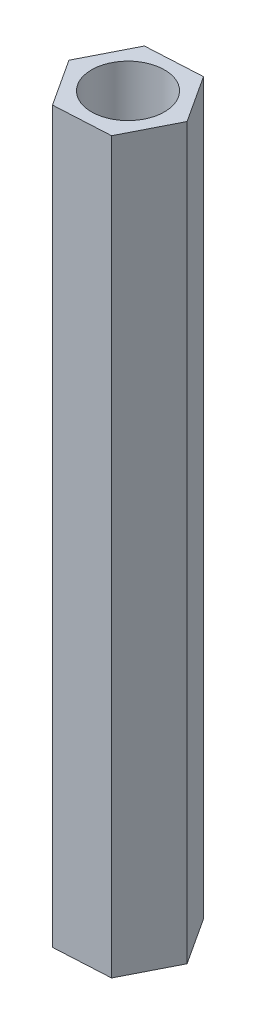
ISO-10303-21;
HEADER;
FILE_DESCRIPTION(('STEP AP214'),'2;1');
FILE_NAME('part.step','',(''),(''),'','','');
FILE_SCHEMA(('AUTOMOTIVE_DESIGN { 1 0 10303 214 1 1 1 1 }'));
ENDSEC;
DATA;
#1=APPLICATION_CONTEXT('core data for automotive mechanical design processes');
#2=APPLICATION_PROTOCOL_DEFINITION('international standard','automotive_design',2000,#1);
#3=PRODUCT_CONTEXT('',#1,'mechanical');
#4=PRODUCT('Part','Part','',(#3));
#5=PRODUCT_RELATED_PRODUCT_CATEGORY('part','',(#4));
#6=PRODUCT_DEFINITION_FORMATION('','',#4);
#7=PRODUCT_DEFINITION_CONTEXT('part definition',#1,'design');
#8=PRODUCT_DEFINITION('design','',#6,#7);
#9=PRODUCT_DEFINITION_SHAPE('','',#8);
#10=(LENGTH_UNIT() NAMED_UNIT(*) SI_UNIT(.MILLI.,.METRE.));
#11=(NAMED_UNIT(*) PLANE_ANGLE_UNIT() SI_UNIT($,.RADIAN.));
#12=(NAMED_UNIT(*) SI_UNIT($,.STERADIAN.) SOLID_ANGLE_UNIT());
#13=UNCERTAINTY_MEASURE_WITH_UNIT(LENGTH_MEASURE(1.E-05),#10,'distance_accuracy_value','');
#14=(GEOMETRIC_REPRESENTATION_CONTEXT(3) GLOBAL_UNCERTAINTY_ASSIGNED_CONTEXT((#13)) GLOBAL_UNIT_ASSIGNED_CONTEXT((#10,
#11,#12)) REPRESENTATION_CONTEXT('',''));
#15=CARTESIAN_POINT('',(0.,0.,0.));
#16=DIRECTION('',(0.,0.,1.));
#17=DIRECTION('',(1.,0.,0.));
#18=AXIS2_PLACEMENT_3D('',#15,#16,#17);
#19=CARTESIAN_POINT('',(0.,30.,0.));
#20=DIRECTION('',(0.,1.,0.));
#21=DIRECTION('',(0.,0.,1.));
#22=AXIS2_PLACEMENT_3D('',#19,#20,#21);
#23=PLANE('',#22);
#24=DIRECTION('',(-0.998564215398102,0.,0.0535677862747038));
#25=VECTOR('',#24,1.);
#26=CARTESIAN_POINT('',(1.04590706457704,30.,-2.05898318244739));
#27=LINE('',#26,#25);
#28=CARTESIAN_POINT('',(1.04590706457704,30.,-2.05898318244739));
#29=VERTEX_POINT('',#28);
#30=CARTESIAN_POINT('',(-1.26017820967585,30.,-1.93527367914502));
#31=VERTEX_POINT('',#30);
#32=EDGE_CURVE('E150',#29,#31,#27,.T.);
#33=ORIENTED_EDGE('',*,*,#32,.T.);
#34=DIRECTION('',(-0.452891043960662,0.,0.891565870982185));
#35=VECTOR('',#34,1.);
#36=CARTESIAN_POINT('',(-1.26017820967585,30.,-1.93527367914502));
#37=LINE('',#36,#35);
#38=CARTESIAN_POINT('',(-2.30608527425289,30.,0.123709503302371));
#39=VERTEX_POINT('',#38);
#40=EDGE_CURVE('E98',#31,#39,#37,.T.);
#41=ORIENTED_EDGE('',*,*,#40,.T.);
#42=DIRECTION('',(0.54567317143744,0.,0.83799808470748));
#43=VECTOR('',#42,1.);
#44=CARTESIAN_POINT('',(-2.30608527425289,30.,0.123709503302371));
#45=LINE('',#44,#43);
#46=CARTESIAN_POINT('',(-1.04590706457703,30.,2.05898318244739));
#47=VERTEX_POINT('',#46);
#48=EDGE_CURVE('E111',#39,#47,#45,.T.);
#49=ORIENTED_EDGE('',*,*,#48,.T.);
#50=DIRECTION('',(0.998564215398102,0.,-0.0535677862747038));
#51=VECTOR('',#50,1.);
#52=CARTESIAN_POINT('',(-1.04590706457703,30.,2.05898318244739));
#53=LINE('',#52,#51);
#54=CARTESIAN_POINT('',(1.26017820967585,30.,1.93527367914502));
#55=VERTEX_POINT('',#54);
#56=EDGE_CURVE('E105',#47,#55,#53,.T.);
#57=ORIENTED_EDGE('',*,*,#56,.T.);
#58=DIRECTION('',(0.452891043960662,0.,-0.891565870982185));
#59=VECTOR('',#58,1.);
#60=CARTESIAN_POINT('',(1.26017820967585,30.,1.93527367914502));
#61=LINE('',#60,#59);
#62=CARTESIAN_POINT('',(2.30608527425289,30.,-0.123709503302371));
#63=VERTEX_POINT('',#62);
#64=EDGE_CURVE('E109',#55,#63,#61,.T.);
#65=ORIENTED_EDGE('',*,*,#64,.T.);
#66=DIRECTION('',(-0.54567317143744,0.,-0.837998084707481));
#67=VECTOR('',#66,1.);
#68=CARTESIAN_POINT('',(2.30608527425289,30.,-0.123709503302371));
#69=LINE('',#68,#67);
#70=EDGE_CURVE('E61',#63,#29,#69,.T.);
#71=ORIENTED_EDGE('',*,*,#70,.T.);
#72=EDGE_LOOP('',(#33,#41,#49,#57,#65,#71));
#73=FACE_BOUND('',#72,.T.);
#74=CARTESIAN_POINT('',(0.,30.,0.));
#75=DIRECTION('',(0.,1.,0.));
#76=DIRECTION('',(0.,0.,1.));
#77=AXIS2_PLACEMENT_3D('',#74,#75,#76);
#78=CIRCLE('',#77,1.5);
#79=CARTESIAN_POINT('',(0.,30.,1.5));
#80=VERTEX_POINT('',#79);
#81=EDGE_CURVE('E138',#80,#80,#78,.T.);
#82=ORIENTED_EDGE('',*,*,#81,.F.);
#83=EDGE_LOOP('',(#82));
#84=FACE_BOUND('',#83,.T.);
#85=ADVANCED_FACE('F43',(#73,#84),#23,.T.);
#86=CARTESIAN_POINT('',(0.,0.,0.));
#87=DIRECTION('',(0.,1.,0.));
#88=DIRECTION('',(0.,0.,1.));
#89=AXIS2_PLACEMENT_3D('',#86,#87,#88);
#90=PLANE('',#89);
#91=DIRECTION('',(-0.998564215398102,0.,0.0535677862747038));
#92=VECTOR('',#91,1.);
#93=CARTESIAN_POINT('',(1.04590706457704,0.,-2.05898318244739));
#94=LINE('',#93,#92);
#95=CARTESIAN_POINT('',(1.04590706457704,0.,-2.05898318244739));
#96=VERTEX_POINT('',#95);
#97=CARTESIAN_POINT('',(-1.26017820967585,0.,-1.93527367914502));
#98=VERTEX_POINT('',#97);
#99=EDGE_CURVE('E133',#96,#98,#94,.T.);
#100=ORIENTED_EDGE('',*,*,#99,.F.);
#101=DIRECTION('',(-0.54567317143744,0.,-0.837998084707481));
#102=VECTOR('',#101,1.);
#103=CARTESIAN_POINT('',(2.30608527425289,0.,-0.123709503302371));
#104=LINE('',#103,#102);
#105=CARTESIAN_POINT('',(2.30608527425289,0.,-0.123709503302371));
#106=VERTEX_POINT('',#105);
#107=EDGE_CURVE('E90',#106,#96,#104,.T.);
#108=ORIENTED_EDGE('',*,*,#107,.F.);
#109=DIRECTION('',(0.452891043960662,0.,-0.891565870982185));
#110=VECTOR('',#109,1.);
#111=CARTESIAN_POINT('',(1.26017820967585,0.,1.93527367914502));
#112=LINE('',#111,#110);
#113=CARTESIAN_POINT('',(1.26017820967585,0.,1.93527367914502));
#114=VERTEX_POINT('',#113);
#115=EDGE_CURVE('E84',#114,#106,#112,.T.);
#116=ORIENTED_EDGE('',*,*,#115,.F.);
#117=DIRECTION('',(0.998564215398102,0.,-0.0535677862747038));
#118=VECTOR('',#117,1.);
#119=CARTESIAN_POINT('',(-1.04590706457703,0.,2.05898318244739));
#120=LINE('',#119,#118);
#121=CARTESIAN_POINT('',(-1.04590706457703,0.,2.05898318244739));
#122=VERTEX_POINT('',#121);
#123=EDGE_CURVE('E120',#122,#114,#120,.T.);
#124=ORIENTED_EDGE('',*,*,#123,.F.);
#125=DIRECTION('',(0.54567317143744,0.,0.83799808470748));
#126=VECTOR('',#125,1.);
#127=CARTESIAN_POINT('',(-2.30608527425289,0.,0.123709503302371));
#128=LINE('',#127,#126);
#129=CARTESIAN_POINT('',(-2.30608527425289,0.,0.123709503302371));
#130=VERTEX_POINT('',#129);
#131=EDGE_CURVE('E141',#130,#122,#128,.T.);
#132=ORIENTED_EDGE('',*,*,#131,.F.);
#133=DIRECTION('',(-0.452891043960662,0.,0.891565870982185));
#134=VECTOR('',#133,1.);
#135=CARTESIAN_POINT('',(-1.26017820967585,0.,-1.93527367914502));
#136=LINE('',#135,#134);
#137=EDGE_CURVE('E137',#98,#130,#136,.T.);
#138=ORIENTED_EDGE('',*,*,#137,.F.);
#139=EDGE_LOOP('',(#100,#108,#116,#124,#132,#138));
#140=FACE_BOUND('',#139,.T.);
#141=CARTESIAN_POINT('',(0.,0.,0.));
#142=DIRECTION('',(0.,1.,0.));
#143=DIRECTION('',(0.,0.,1.));
#144=AXIS2_PLACEMENT_3D('',#141,#142,#143);
#145=CIRCLE('',#144,1.5);
#146=CARTESIAN_POINT('',(0.,0.,1.5));
#147=VERTEX_POINT('',#146);
#148=EDGE_CURVE('E265',#147,#147,#145,.T.);
#149=ORIENTED_EDGE('',*,*,#148,.T.);
#150=EDGE_LOOP('',(#149));
#151=FACE_BOUND('',#150,.T.);
#152=ADVANCED_FACE('F163',(#140,#151),#90,.F.);
#153=CARTESIAN_POINT('',(1.04590706457704,30.,-2.05898318244739));
#154=DIRECTION('',(0.0535677862747038,0.,0.998564215398102));
#155=DIRECTION('',(0.998564215398102,0.,-0.0535677862747038));
#156=AXIS2_PLACEMENT_3D('',#153,#154,#155);
#157=PLANE('',#156);
#158=ORIENTED_EDGE('',*,*,#99,.T.);
#159=DIRECTION('',(0.,-1.,0.));
#160=VECTOR('',#159,1.);
#161=CARTESIAN_POINT('',(-1.26017820967585,30.,-1.93527367914502));
#162=LINE('',#161,#160);
#163=EDGE_CURVE('E11',#31,#98,#162,.T.);
#164=ORIENTED_EDGE('',*,*,#163,.F.);
#165=ORIENTED_EDGE('',*,*,#32,.F.);
#166=DIRECTION('',(0.,-1.,0.));
#167=VECTOR('',#166,1.);
#168=CARTESIAN_POINT('',(1.04590706457704,30.,-2.05898318244739));
#169=LINE('',#168,#167);
#170=EDGE_CURVE('E129',#29,#96,#169,.T.);
#171=ORIENTED_EDGE('',*,*,#170,.T.);
#172=EDGE_LOOP('',(#158,#164,#165,#171));
#173=FACE_BOUND('',#172,.T.);
#174=ADVANCED_FACE('F45',(#173),#157,.F.);
#175=CARTESIAN_POINT('',(-1.26017820967585,30.,-1.93527367914502));
#176=DIRECTION('',(0.891565870982185,0.,0.452891043960662));
#177=DIRECTION('',(0.452891043960662,0.,-0.891565870982185));
#178=AXIS2_PLACEMENT_3D('',#175,#176,#177);
#179=PLANE('',#178);
#180=ORIENTED_EDGE('',*,*,#137,.T.);
#181=DIRECTION('',(0.,-1.,0.));
#182=VECTOR('',#181,1.);
#183=CARTESIAN_POINT('',(-2.30608527425289,30.,0.123709503302371));
#184=LINE('',#183,#182);
#185=EDGE_CURVE('E53',#39,#130,#184,.T.);
#186=ORIENTED_EDGE('',*,*,#185,.F.);
#187=ORIENTED_EDGE('',*,*,#40,.F.);
#188=ORIENTED_EDGE('',*,*,#163,.T.);
#189=EDGE_LOOP('',(#180,#186,#187,#188));
#190=FACE_BOUND('',#189,.T.);
#191=ADVANCED_FACE('F188',(#190),#179,.F.);
#192=CARTESIAN_POINT('',(-2.30608527425289,30.,0.123709503302371));
#193=DIRECTION('',(0.83799808470748,0.,-0.54567317143744));
#194=DIRECTION('',(-0.54567317143744,0.,-0.83799808470748));
#195=AXIS2_PLACEMENT_3D('',#192,#193,#194);
#196=PLANE('',#195);
#197=ORIENTED_EDGE('',*,*,#131,.T.);
#198=DIRECTION('',(0.,-1.,0.));
#199=VECTOR('',#198,1.);
#200=CARTESIAN_POINT('',(-1.04590706457703,30.,2.05898318244739));
#201=LINE('',#200,#199);
#202=EDGE_CURVE('E122',#47,#122,#201,.T.);
#203=ORIENTED_EDGE('',*,*,#202,.F.);
#204=ORIENTED_EDGE('',*,*,#48,.F.);
#205=ORIENTED_EDGE('',*,*,#185,.T.);
#206=EDGE_LOOP('',(#197,#203,#204,#205));
#207=FACE_BOUND('',#206,.T.);
#208=ADVANCED_FACE('F160',(#207),#196,.F.);
#209=CARTESIAN_POINT('',(-1.04590706457703,30.,2.05898318244739));
#210=DIRECTION('',(-0.0535677862747038,0.,-0.998564215398102));
#211=DIRECTION('',(-0.998564215398102,0.,0.0535677862747038));
#212=AXIS2_PLACEMENT_3D('',#209,#210,#211);
#213=PLANE('',#212);
#214=ORIENTED_EDGE('',*,*,#123,.T.);
#215=DIRECTION('',(0.,-1.,0.));
#216=VECTOR('',#215,1.);
#217=CARTESIAN_POINT('',(1.26017820967585,30.,1.93527367914502));
#218=LINE('',#217,#216);
#219=EDGE_CURVE('E117',#55,#114,#218,.T.);
#220=ORIENTED_EDGE('',*,*,#219,.F.);
#221=ORIENTED_EDGE('',*,*,#56,.F.);
#222=ORIENTED_EDGE('',*,*,#202,.T.);
#223=EDGE_LOOP('',(#214,#220,#221,#222));
#224=FACE_BOUND('',#223,.T.);
#225=ADVANCED_FACE('F118',(#224),#213,.F.);
#226=CARTESIAN_POINT('',(1.26017820967585,30.,1.93527367914502));
#227=DIRECTION('',(-0.891565870982185,0.,-0.452891043960662));
#228=DIRECTION('',(-0.452891043960662,0.,0.891565870982185));
#229=AXIS2_PLACEMENT_3D('',#226,#227,#228);
#230=PLANE('',#229);
#231=ORIENTED_EDGE('',*,*,#115,.T.);
#232=DIRECTION('',(0.,-1.,0.));
#233=VECTOR('',#232,1.);
#234=CARTESIAN_POINT('',(2.30608527425289,30.,-0.123709503302371));
#235=LINE('',#234,#233);
#236=EDGE_CURVE('E123',#63,#106,#235,.T.);
#237=ORIENTED_EDGE('',*,*,#236,.F.);
#238=ORIENTED_EDGE('',*,*,#64,.F.);
#239=ORIENTED_EDGE('',*,*,#219,.T.);
#240=EDGE_LOOP('',(#231,#237,#238,#239));
#241=FACE_BOUND('',#240,.T.);
#242=ADVANCED_FACE('F125',(#241),#230,.F.);
#243=CARTESIAN_POINT('',(2.30608527425289,30.,-0.123709503302371));
#244=DIRECTION('',(-0.837998084707481,0.,0.54567317143744));
#245=DIRECTION('',(0.54567317143744,0.,0.837998084707481));
#246=AXIS2_PLACEMENT_3D('',#243,#244,#245);
#247=PLANE('',#246);
#248=ORIENTED_EDGE('',*,*,#107,.T.);
#249=ORIENTED_EDGE('',*,*,#170,.F.);
#250=ORIENTED_EDGE('',*,*,#70,.F.);
#251=ORIENTED_EDGE('',*,*,#236,.T.);
#252=EDGE_LOOP('',(#248,#249,#250,#251));
#253=FACE_BOUND('',#252,.T.);
#254=ADVANCED_FACE('F168',(#253),#247,.F.);
#255=CARTESIAN_POINT('',(0.,30.,0.));
#256=DIRECTION('',(0.,-1.,0.));
#257=DIRECTION('',(0.,0.,-1.));
#258=AXIS2_PLACEMENT_3D('',#255,#256,#257);
#259=CYLINDRICAL_SURFACE('',#258,1.5);
#260=ORIENTED_EDGE('',*,*,#81,.T.);
#261=EDGE_LOOP('',(#260));
#262=FACE_BOUND('',#261,.T.);
#263=ORIENTED_EDGE('',*,*,#148,.F.);
#264=EDGE_LOOP('',(#263));
#265=FACE_BOUND('',#264,.T.);
#266=ADVANCED_FACE('F170',(#262,#265),#259,.F.);
#267=CLOSED_SHELL('',(#85,#152,#174,#191,#208,#225,#242,#254,#266));
#268=MANIFOLD_SOLID_BREP('B2',#267);
#269=ADVANCED_BREP_SHAPE_REPRESENTATION('',(#18,#268),#14);
#270=SHAPE_DEFINITION_REPRESENTATION(#9,#269);
ENDSEC;
END-ISO-10303-21;
